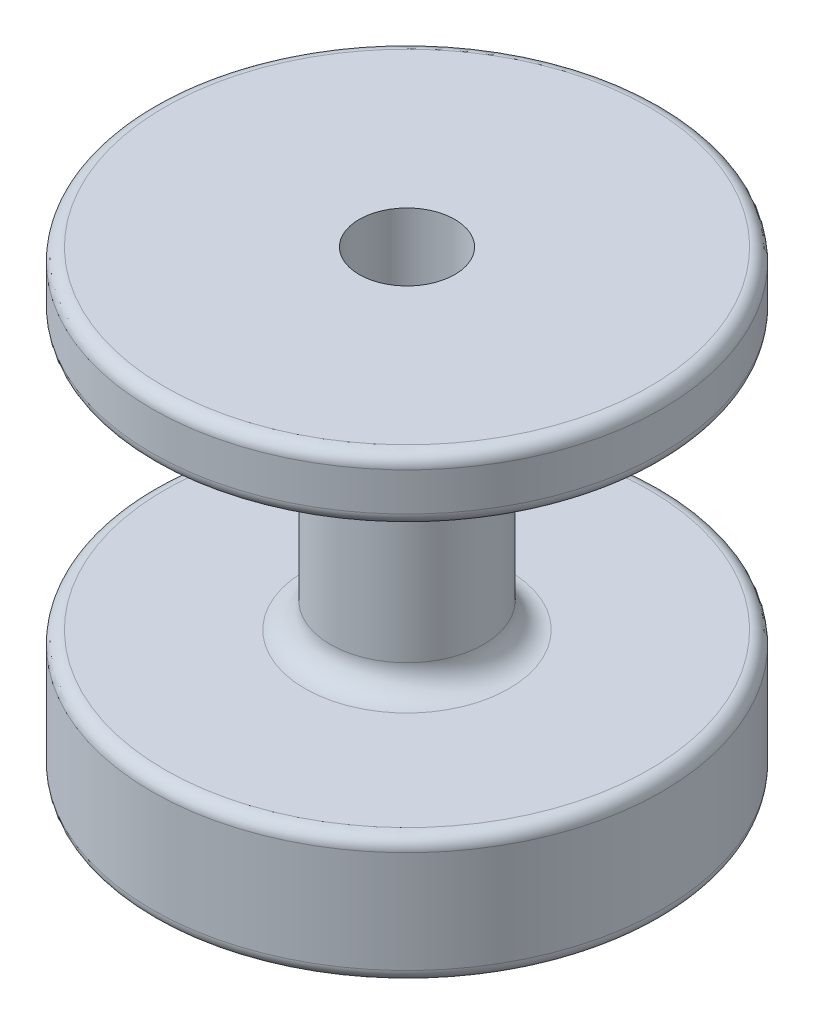
ISO-10303-21;
HEADER;
FILE_DESCRIPTION(('STEP AP214'),'2;1');
FILE_NAME('part.step','',(''),(''),'','','');
FILE_SCHEMA(('AUTOMOTIVE_DESIGN { 1 0 10303 214 1 1 1 1 }'));
ENDSEC;
DATA;
#1=APPLICATION_CONTEXT('core data for automotive mechanical design processes');
#2=APPLICATION_PROTOCOL_DEFINITION('international standard','automotive_design',2000,#1);
#3=PRODUCT_CONTEXT('',#1,'mechanical');
#4=PRODUCT('Part','Part','',(#3));
#5=PRODUCT_RELATED_PRODUCT_CATEGORY('part','',(#4));
#6=PRODUCT_DEFINITION_FORMATION('','',#4);
#7=PRODUCT_DEFINITION_CONTEXT('part definition',#1,'design');
#8=PRODUCT_DEFINITION('design','',#6,#7);
#9=PRODUCT_DEFINITION_SHAPE('','',#8);
#10=(LENGTH_UNIT() NAMED_UNIT(*) SI_UNIT(.MILLI.,.METRE.));
#11=(NAMED_UNIT(*) PLANE_ANGLE_UNIT() SI_UNIT($,.RADIAN.));
#12=(NAMED_UNIT(*) SI_UNIT($,.STERADIAN.) SOLID_ANGLE_UNIT());
#13=UNCERTAINTY_MEASURE_WITH_UNIT(LENGTH_MEASURE(1.E-05),#10,'distance_accuracy_value','');
#14=(GEOMETRIC_REPRESENTATION_CONTEXT(3) GLOBAL_UNCERTAINTY_ASSIGNED_CONTEXT((#13)) GLOBAL_UNIT_ASSIGNED_CONTEXT((#10,
#11,#12)) REPRESENTATION_CONTEXT('',''));
#15=CARTESIAN_POINT('',(0.,0.,0.));
#16=DIRECTION('',(0.,0.,1.));
#17=DIRECTION('',(1.,0.,0.));
#18=AXIS2_PLACEMENT_3D('',#15,#16,#17);
#19=CARTESIAN_POINT('',(0.,47.,0.));
#20=DIRECTION('',(0.,-1.,0.));
#21=DIRECTION('',(0.,0.,-1.));
#22=AXIS2_PLACEMENT_3D('',#19,#20,#21);
#23=CYLINDRICAL_SURFACE('',#22,2.);
#24=CARTESIAN_POINT('',(0.,0.,0.));
#25=DIRECTION('',(0.,1.,0.));
#26=DIRECTION('',(0.,0.,1.));
#27=AXIS2_PLACEMENT_3D('',#24,#25,#26);
#28=CIRCLE('',#27,2.);
#29=CARTESIAN_POINT('',(0.,0.,2.));
#30=VERTEX_POINT('',#29);
#31=EDGE_CURVE('E79',#30,#30,#28,.F.);
#32=ORIENTED_EDGE('',*,*,#31,.T.);
#33=EDGE_LOOP('',(#32));
#34=FACE_BOUND('',#33,.T.);
#35=CARTESIAN_POINT('',(0.,19.,0.));
#36=DIRECTION('',(0.,1.,0.));
#37=DIRECTION('',(0.,0.,1.));
#38=AXIS2_PLACEMENT_3D('',#35,#36,#37);
#39=CIRCLE('',#38,2.);
#40=CARTESIAN_POINT('',(0.,19.,2.));
#41=VERTEX_POINT('',#40);
#42=EDGE_CURVE('E80',#41,#41,#39,.T.);
#43=ORIENTED_EDGE('',*,*,#42,.T.);
#44=EDGE_LOOP('',(#43));
#45=FACE_BOUND('',#44,.T.);
#46=ADVANCED_FACE('F35',(#34,#45),#23,.F.);
#47=CARTESIAN_POINT('',(0.,36.,0.));
#48=DIRECTION('',(0.,-1.,0.));
#49=DIRECTION('',(0.,0.,-1.));
#50=AXIS2_PLACEMENT_3D('',#47,#48,#49);
#51=CYLINDRICAL_SURFACE('',#50,20.);
#52=CARTESIAN_POINT('',(0.,35.,0.));
#53=DIRECTION('',(0.,1.,0.));
#54=DIRECTION('',(0.,0.,1.));
#55=AXIS2_PLACEMENT_3D('',#52,#53,#54);
#56=CIRCLE('',#55,20.);
#57=CARTESIAN_POINT('',(0.,35.,20.));
#58=VERTEX_POINT('',#57);
#59=EDGE_CURVE('E58',#58,#58,#56,.F.);
#60=ORIENTED_EDGE('',*,*,#59,.T.);
#61=EDGE_LOOP('',(#60));
#62=FACE_BOUND('',#61,.T.);
#63=CARTESIAN_POINT('',(0.,32.,0.));
#64=DIRECTION('',(0.,1.,0.));
#65=DIRECTION('',(0.,0.,1.));
#66=AXIS2_PLACEMENT_3D('',#63,#64,#65);
#67=CIRCLE('',#66,20.);
#68=CARTESIAN_POINT('',(0.,32.,20.));
#69=VERTEX_POINT('',#68);
#70=EDGE_CURVE('E61',#69,#69,#67,.T.);
#71=ORIENTED_EDGE('',*,*,#70,.T.);
#72=EDGE_LOOP('',(#71));
#73=FACE_BOUND('',#72,.T.);
#74=ADVANCED_FACE('F104',(#62,#73),#51,.T.);
#75=CARTESIAN_POINT('',(0.,36.,0.));
#76=DIRECTION('',(0.,1.,0.));
#77=DIRECTION('',(0.,0.,1.));
#78=AXIS2_PLACEMENT_3D('',#75,#76,#77);
#79=PLANE('',#78);
#80=CARTESIAN_POINT('',(0.,36.,0.));
#81=DIRECTION('',(0.,1.,0.));
#82=DIRECTION('',(0.,0.,1.));
#83=AXIS2_PLACEMENT_3D('',#80,#81,#82);
#84=CIRCLE('',#83,19.);
#85=CARTESIAN_POINT('',(0.,36.,19.));
#86=VERTEX_POINT('',#85);
#87=EDGE_CURVE('E64',#86,#86,#84,.T.);
#88=ORIENTED_EDGE('',*,*,#87,.T.);
#89=EDGE_LOOP('',(#88));
#90=FACE_BOUND('',#89,.T.);
#91=CARTESIAN_POINT('',(0.,36.,0.));
#92=DIRECTION('',(0.,1.,0.));
#93=DIRECTION('',(0.,0.,1.));
#94=AXIS2_PLACEMENT_3D('',#91,#92,#93);
#95=CIRCLE('',#94,3.75);
#96=CARTESIAN_POINT('',(0.,36.,3.75));
#97=VERTEX_POINT('',#96);
#98=EDGE_CURVE('E86',#97,#97,#95,.T.);
#99=ORIENTED_EDGE('',*,*,#98,.F.);
#100=EDGE_LOOP('',(#99));
#101=FACE_BOUND('',#100,.T.);
#102=ADVANCED_FACE('F101',(#90,#101),#79,.T.);
#103=CARTESIAN_POINT('',(0.,31.,0.));
#104=DIRECTION('',(0.,-1.,0.));
#105=DIRECTION('',(0.,0.,-1.));
#106=AXIS2_PLACEMENT_3D('',#103,#104,#105);
#107=CYLINDRICAL_SURFACE('',#106,6.);
#108=CARTESIAN_POINT('',(0.,12.,0.));
#109=DIRECTION('',(0.,1.,0.));
#110=DIRECTION('',(0.,0.,1.));
#111=AXIS2_PLACEMENT_3D('',#108,#109,#110);
#112=CIRCLE('',#111,6.);
#113=CARTESIAN_POINT('',(0.,12.,6.));
#114=VERTEX_POINT('',#113);
#115=EDGE_CURVE('E73',#114,#114,#112,.T.);
#116=ORIENTED_EDGE('',*,*,#115,.T.);
#117=EDGE_LOOP('',(#116));
#118=FACE_BOUND('',#117,.T.);
#119=CARTESIAN_POINT('',(0.,29.,0.));
#120=DIRECTION('',(0.,1.,0.));
#121=DIRECTION('',(0.,0.,1.));
#122=AXIS2_PLACEMENT_3D('',#119,#120,#121);
#123=CIRCLE('',#122,6.);
#124=CARTESIAN_POINT('',(0.,29.,6.));
#125=VERTEX_POINT('',#124);
#126=EDGE_CURVE('E76',#125,#125,#123,.F.);
#127=ORIENTED_EDGE('',*,*,#126,.T.);
#128=EDGE_LOOP('',(#127));
#129=FACE_BOUND('',#128,.T.);
#130=ADVANCED_FACE('F103',(#118,#129),#107,.T.);
#131=CARTESIAN_POINT('',(0.,31.,0.));
#132=DIRECTION('',(0.,1.,0.));
#133=DIRECTION('',(0.,0.,1.));
#134=AXIS2_PLACEMENT_3D('',#131,#132,#133);
#135=PLANE('',#134);
#136=CARTESIAN_POINT('',(0.,31.,0.));
#137=DIRECTION('',(0.,1.,0.));
#138=DIRECTION('',(0.,0.,1.));
#139=AXIS2_PLACEMENT_3D('',#136,#137,#138);
#140=CIRCLE('',#139,19.);
#141=CARTESIAN_POINT('',(0.,31.,19.));
#142=VERTEX_POINT('',#141);
#143=EDGE_CURVE('E55',#142,#142,#140,.F.);
#144=ORIENTED_EDGE('',*,*,#143,.T.);
#145=EDGE_LOOP('',(#144));
#146=FACE_BOUND('',#145,.T.);
#147=CARTESIAN_POINT('',(0.,31.,0.));
#148=DIRECTION('',(0.,1.,0.));
#149=DIRECTION('',(0.,0.,1.));
#150=AXIS2_PLACEMENT_3D('',#147,#148,#149);
#151=CIRCLE('',#150,8.);
#152=CARTESIAN_POINT('',(0.,31.,8.));
#153=VERTEX_POINT('',#152);
#154=EDGE_CURVE('E67',#153,#153,#151,.T.);
#155=ORIENTED_EDGE('',*,*,#154,.T.);
#156=EDGE_LOOP('',(#155));
#157=FACE_BOUND('',#156,.T.);
#158=ADVANCED_FACE('F111',(#146,#157),#135,.F.);
#159=CARTESIAN_POINT('',(0.,10.,0.));
#160=DIRECTION('',(0.,1.,0.));
#161=DIRECTION('',(0.,0.,1.));
#162=AXIS2_PLACEMENT_3D('',#159,#160,#161);
#163=PLANE('',#162);
#164=CARTESIAN_POINT('',(0.,10.,0.));
#165=DIRECTION('',(0.,1.,0.));
#166=DIRECTION('',(0.,0.,1.));
#167=AXIS2_PLACEMENT_3D('',#164,#165,#166);
#168=CIRCLE('',#167,19.);
#169=CARTESIAN_POINT('',(0.,10.,19.));
#170=VERTEX_POINT('',#169);
#171=EDGE_CURVE('E50',#170,#170,#168,.T.);
#172=ORIENTED_EDGE('',*,*,#171,.T.);
#173=EDGE_LOOP('',(#172));
#174=FACE_BOUND('',#173,.T.);
#175=CARTESIAN_POINT('',(0.,10.,0.));
#176=DIRECTION('',(0.,1.,0.));
#177=DIRECTION('',(0.,0.,1.));
#178=AXIS2_PLACEMENT_3D('',#175,#176,#177);
#179=CIRCLE('',#178,8.);
#180=CARTESIAN_POINT('',(0.,10.,8.));
#181=VERTEX_POINT('',#180);
#182=EDGE_CURVE('E70',#181,#181,#179,.F.);
#183=ORIENTED_EDGE('',*,*,#182,.T.);
#184=EDGE_LOOP('',(#183));
#185=FACE_BOUND('',#184,.T.);
#186=ADVANCED_FACE('F129',(#174,#185),#163,.T.);
#187=CARTESIAN_POINT('',(0.,0.,0.));
#188=DIRECTION('',(0.,1.,0.));
#189=DIRECTION('',(0.,0.,1.));
#190=AXIS2_PLACEMENT_3D('',#187,#188,#189);
#191=PLANE('',#190);
#192=CARTESIAN_POINT('',(0.,0.,0.));
#193=DIRECTION('',(0.,1.,0.));
#194=DIRECTION('',(0.,0.,1.));
#195=AXIS2_PLACEMENT_3D('',#192,#193,#194);
#196=CIRCLE('',#195,19.);
#197=CARTESIAN_POINT('',(0.,0.,19.));
#198=VERTEX_POINT('',#197);
#199=EDGE_CURVE('E10',#198,#198,#196,.F.);
#200=ORIENTED_EDGE('',*,*,#199,.T.);
#201=EDGE_LOOP('',(#200));
#202=FACE_BOUND('',#201,.T.);
#203=ORIENTED_EDGE('',*,*,#31,.F.);
#204=EDGE_LOOP('',(#203));
#205=FACE_BOUND('',#204,.T.);
#206=ADVANCED_FACE('F132',(#202,#205),#191,.F.);
#207=CARTESIAN_POINT('',(0.,9.,0.));
#208=DIRECTION('',(0.,1.,0.));
#209=DIRECTION('',(0.,0.,1.));
#210=AXIS2_PLACEMENT_3D('',#207,#208,#209);
#211=CIRCLE('',#210,20.);
#212=CARTESIAN_POINT('',(0.,9.,20.));
#213=VERTEX_POINT('',#212);
#214=EDGE_CURVE('E42',#213,#213,#211,.F.);
#215=ORIENTED_EDGE('',*,*,#214,.T.);
#216=EDGE_LOOP('',(#215));
#217=FACE_BOUND('',#216,.T.);
#218=CARTESIAN_POINT('',(0.,1.,0.));
#219=DIRECTION('',(0.,1.,0.));
#220=DIRECTION('',(0.,0.,1.));
#221=AXIS2_PLACEMENT_3D('',#218,#219,#220);
#222=CIRCLE('',#221,20.);
#223=CARTESIAN_POINT('',(0.,1.,20.));
#224=VERTEX_POINT('',#223);
#225=EDGE_CURVE('E46',#224,#224,#222,.T.);
#226=ORIENTED_EDGE('',*,*,#225,.T.);
#227=EDGE_LOOP('',(#226));
#228=FACE_BOUND('',#227,.T.);
#229=ADVANCED_FACE('F97',(#217,#228),#51,.T.);
#230=CARTESIAN_POINT('',(0.,19.,0.));
#231=DIRECTION('',(0.,1.,0.));
#232=DIRECTION('',(0.,0.,1.));
#233=AXIS2_PLACEMENT_3D('',#230,#231,#232);
#234=CYLINDRICAL_SURFACE('',#233,3.75);
#235=CARTESIAN_POINT('',(0.,19.,0.));
#236=DIRECTION('',(0.,1.,0.));
#237=DIRECTION('',(0.,0.,1.));
#238=AXIS2_PLACEMENT_3D('',#235,#236,#237);
#239=CIRCLE('',#238,3.75);
#240=CARTESIAN_POINT('',(0.,19.,3.75));
#241=VERTEX_POINT('',#240);
#242=EDGE_CURVE('E83',#241,#241,#239,.T.);
#243=ORIENTED_EDGE('',*,*,#242,.F.);
#244=EDGE_LOOP('',(#243));
#245=FACE_BOUND('',#244,.T.);
#246=ORIENTED_EDGE('',*,*,#98,.T.);
#247=EDGE_LOOP('',(#246));
#248=FACE_BOUND('',#247,.T.);
#249=ADVANCED_FACE('F94',(#245,#248),#234,.F.);
#250=CARTESIAN_POINT('',(0.,19.,0.));
#251=DIRECTION('',(0.,1.,0.));
#252=DIRECTION('',(0.,0.,1.));
#253=AXIS2_PLACEMENT_3D('',#250,#251,#252);
#254=PLANE('',#253);
#255=ORIENTED_EDGE('',*,*,#42,.F.);
#256=EDGE_LOOP('',(#255));
#257=FACE_BOUND('',#256,.T.);
#258=ORIENTED_EDGE('',*,*,#242,.T.);
#259=EDGE_LOOP('',(#258));
#260=FACE_BOUND('',#259,.T.);
#261=ADVANCED_FACE('F92',(#257,#260),#254,.T.);
#262=CARTESIAN_POINT('',(0.,12.,0.));
#263=DIRECTION('',(0.,1.,0.));
#264=DIRECTION('',(0.,0.,1.));
#265=AXIS2_PLACEMENT_3D('',#262,#263,#264);
#266=TOROIDAL_SURFACE('',#265,8.,2.);
#267=ORIENTED_EDGE('',*,*,#182,.F.);
#268=EDGE_LOOP('',(#267));
#269=FACE_BOUND('',#268,.T.);
#270=ORIENTED_EDGE('',*,*,#115,.F.);
#271=EDGE_LOOP('',(#270));
#272=FACE_BOUND('',#271,.T.);
#273=ADVANCED_FACE('F141',(#269,#272),#266,.F.);
#274=CARTESIAN_POINT('',(0.,29.,0.));
#275=DIRECTION('',(0.,1.,0.));
#276=DIRECTION('',(0.,0.,1.));
#277=AXIS2_PLACEMENT_3D('',#274,#275,#276);
#278=TOROIDAL_SURFACE('',#277,8.,2.);
#279=ORIENTED_EDGE('',*,*,#126,.F.);
#280=EDGE_LOOP('',(#279));
#281=FACE_BOUND('',#280,.T.);
#282=ORIENTED_EDGE('',*,*,#154,.F.);
#283=EDGE_LOOP('',(#282));
#284=FACE_BOUND('',#283,.T.);
#285=ADVANCED_FACE('F144',(#281,#284),#278,.F.);
#286=CARTESIAN_POINT('',(0.,35.,0.));
#287=DIRECTION('',(0.,1.,0.));
#288=DIRECTION('',(0.,0.,1.));
#289=AXIS2_PLACEMENT_3D('',#286,#287,#288);
#290=TOROIDAL_SURFACE('',#289,19.,1.);
#291=ORIENTED_EDGE('',*,*,#59,.F.);
#292=EDGE_LOOP('',(#291));
#293=FACE_BOUND('',#292,.T.);
#294=ORIENTED_EDGE('',*,*,#87,.F.);
#295=EDGE_LOOP('',(#294));
#296=FACE_BOUND('',#295,.T.);
#297=ADVANCED_FACE('F152',(#293,#296),#290,.T.);
#298=CARTESIAN_POINT('',(0.,32.,0.));
#299=DIRECTION('',(0.,1.,0.));
#300=DIRECTION('',(0.,0.,1.));
#301=AXIS2_PLACEMENT_3D('',#298,#299,#300);
#302=TOROIDAL_SURFACE('',#301,19.,1.);
#303=ORIENTED_EDGE('',*,*,#143,.F.);
#304=EDGE_LOOP('',(#303));
#305=FACE_BOUND('',#304,.T.);
#306=ORIENTED_EDGE('',*,*,#70,.F.);
#307=EDGE_LOOP('',(#306));
#308=FACE_BOUND('',#307,.T.);
#309=ADVANCED_FACE('F159',(#305,#308),#302,.T.);
#310=CARTESIAN_POINT('',(0.,9.,0.));
#311=DIRECTION('',(0.,1.,0.));
#312=DIRECTION('',(0.,0.,1.));
#313=AXIS2_PLACEMENT_3D('',#310,#311,#312);
#314=TOROIDAL_SURFACE('',#313,19.,1.);
#315=ORIENTED_EDGE('',*,*,#214,.F.);
#316=EDGE_LOOP('',(#315));
#317=FACE_BOUND('',#316,.T.);
#318=ORIENTED_EDGE('',*,*,#171,.F.);
#319=EDGE_LOOP('',(#318));
#320=FACE_BOUND('',#319,.T.);
#321=ADVANCED_FACE('F164',(#317,#320),#314,.T.);
#322=CARTESIAN_POINT('',(0.,1.,0.));
#323=DIRECTION('',(0.,1.,0.));
#324=DIRECTION('',(0.,0.,1.));
#325=AXIS2_PLACEMENT_3D('',#322,#323,#324);
#326=TOROIDAL_SURFACE('',#325,19.,1.);
#327=ORIENTED_EDGE('',*,*,#199,.F.);
#328=EDGE_LOOP('',(#327));
#329=FACE_BOUND('',#328,.T.);
#330=ORIENTED_EDGE('',*,*,#225,.F.);
#331=EDGE_LOOP('',(#330));
#332=FACE_BOUND('',#331,.T.);
#333=ADVANCED_FACE('F37',(#329,#332),#326,.T.);
#334=CLOSED_SHELL('',(#46,#74,#102,#130,#158,#186,#206,#229,#249,#261,#273,#285,#297,#309,#321,#333));
#335=MANIFOLD_SOLID_BREP('B2',#334);
#336=ADVANCED_BREP_SHAPE_REPRESENTATION('',(#18,#335),#14);
#337=SHAPE_DEFINITION_REPRESENTATION(#9,#336);
ENDSEC;
END-ISO-10303-21;
